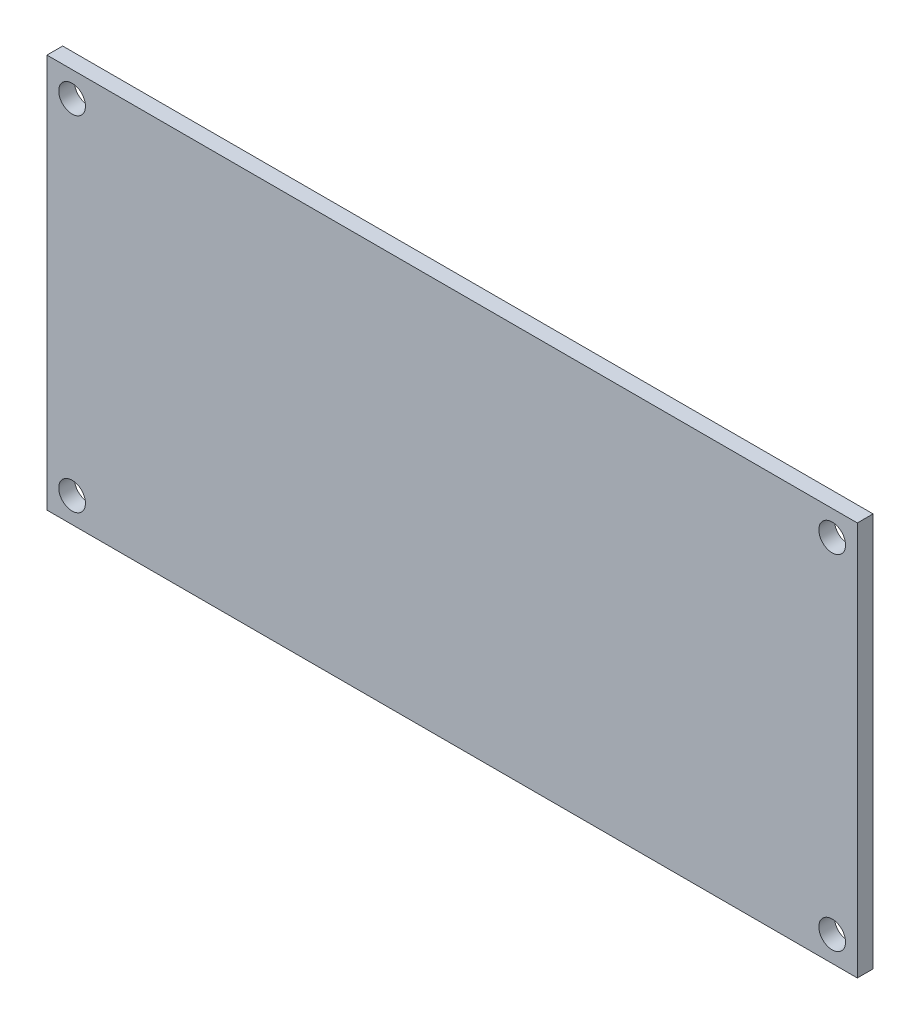
ISO-10303-21;
HEADER;
FILE_DESCRIPTION(('STEP AP214'),'2;1');
FILE_NAME('part.step','',(''),(''),'','','');
FILE_SCHEMA(('AUTOMOTIVE_DESIGN { 1 0 10303 214 1 1 1 1 }'));
ENDSEC;
DATA;
#1=APPLICATION_CONTEXT('core data for automotive mechanical design processes');
#2=APPLICATION_PROTOCOL_DEFINITION('international standard','automotive_design',2000,#1);
#3=PRODUCT_CONTEXT('',#1,'mechanical');
#4=PRODUCT('Part','Part','',(#3));
#5=PRODUCT_RELATED_PRODUCT_CATEGORY('part','',(#4));
#6=PRODUCT_DEFINITION_FORMATION('','',#4);
#7=PRODUCT_DEFINITION_CONTEXT('part definition',#1,'design');
#8=PRODUCT_DEFINITION('design','',#6,#7);
#9=PRODUCT_DEFINITION_SHAPE('','',#8);
#10=(LENGTH_UNIT() NAMED_UNIT(*) SI_UNIT(.MILLI.,.METRE.));
#11=(NAMED_UNIT(*) PLANE_ANGLE_UNIT() SI_UNIT($,.RADIAN.));
#12=(NAMED_UNIT(*) SI_UNIT($,.STERADIAN.) SOLID_ANGLE_UNIT());
#13=UNCERTAINTY_MEASURE_WITH_UNIT(LENGTH_MEASURE(1.E-05),#10,'distance_accuracy_value','');
#14=(GEOMETRIC_REPRESENTATION_CONTEXT(3) GLOBAL_UNCERTAINTY_ASSIGNED_CONTEXT((#13)) GLOBAL_UNIT_ASSIGNED_CONTEXT((#10,
#11,#12)) REPRESENTATION_CONTEXT('',''));
#15=CARTESIAN_POINT('',(0.,0.,0.));
#16=DIRECTION('',(0.,0.,1.));
#17=DIRECTION('',(1.,0.,0.));
#18=AXIS2_PLACEMENT_3D('',#15,#16,#17);
#19=CARTESIAN_POINT('',(3147.17675716415,1169.36369471235,1.5875));
#20=DIRECTION('',(-1.,0.,0.));
#21=DIRECTION('',(0.,0.,1.));
#22=AXIS2_PLACEMENT_3D('',#19,#20,#21);
#23=PLANE('',#22);
#24=DIRECTION('',(0.,1.,0.));
#25=VECTOR('',#24,1.);
#26=CARTESIAN_POINT('',(3147.17675716415,1169.36369471235,0.));
#27=LINE('',#26,#25);
#28=CARTESIAN_POINT('',(3147.17675716415,1129.54769471235,0.));
#29=VERTEX_POINT('',#28);
#30=CARTESIAN_POINT('',(3147.17675716415,1169.36369471235,0.));
#31=VERTEX_POINT('',#30);
#32=EDGE_CURVE('E95',#29,#31,#27,.T.);
#33=ORIENTED_EDGE('',*,*,#32,.T.);
#34=DIRECTION('',(0.,0.,-1.));
#35=VECTOR('',#34,1.);
#36=CARTESIAN_POINT('',(3147.17675716415,1169.36369471235,1.5875));
#37=LINE('',#36,#35);
#38=CARTESIAN_POINT('',(3147.17675716415,1169.36369471235,1.5875));
#39=VERTEX_POINT('',#38);
#40=EDGE_CURVE('E11',#39,#31,#37,.T.);
#41=ORIENTED_EDGE('',*,*,#40,.F.);
#42=DIRECTION('',(0.,1.,0.));
#43=VECTOR('',#42,1.);
#44=CARTESIAN_POINT('',(3147.17675716415,1169.36369471235,1.5875));
#45=LINE('',#44,#43);
#46=CARTESIAN_POINT('',(3147.17675716415,1129.54769471235,1.5875));
#47=VERTEX_POINT('',#46);
#48=EDGE_CURVE('E83',#47,#39,#45,.T.);
#49=ORIENTED_EDGE('',*,*,#48,.F.);
#50=DIRECTION('',(0.,0.,-1.));
#51=VECTOR('',#50,1.);
#52=CARTESIAN_POINT('',(3147.17675716415,1129.54769471235,1.5875));
#53=LINE('',#52,#51);
#54=EDGE_CURVE('E91',#47,#29,#53,.T.);
#55=ORIENTED_EDGE('',*,*,#54,.T.);
#56=EDGE_LOOP('',(#33,#41,#49,#55));
#57=FACE_BOUND('',#56,.T.);
#58=ADVANCED_FACE('F32',(#57),#23,.F.);
#59=CARTESIAN_POINT('',(3065.30075716415,1169.36369471235,1.5875));
#60=DIRECTION('',(0.,-1.,0.));
#61=DIRECTION('',(0.,0.,-1.));
#62=AXIS2_PLACEMENT_3D('',#59,#60,#61);
#63=PLANE('',#62);
#64=DIRECTION('',(-1.,0.,0.));
#65=VECTOR('',#64,1.);
#66=CARTESIAN_POINT('',(3065.30075716415,1169.36369471235,0.));
#67=LINE('',#66,#65);
#68=CARTESIAN_POINT('',(3065.30075716415,1169.36369471235,0.));
#69=VERTEX_POINT('',#68);
#70=EDGE_CURVE('E87',#31,#69,#67,.T.);
#71=ORIENTED_EDGE('',*,*,#70,.T.);
#72=DIRECTION('',(0.,0.,-1.));
#73=VECTOR('',#72,1.);
#74=CARTESIAN_POINT('',(3065.30075716415,1169.36369471235,1.5875));
#75=LINE('',#74,#73);
#76=CARTESIAN_POINT('',(3065.30075716415,1169.36369471235,1.5875));
#77=VERTEX_POINT('',#76);
#78=EDGE_CURVE('E40',#77,#69,#75,.T.);
#79=ORIENTED_EDGE('',*,*,#78,.F.);
#80=DIRECTION('',(-1.,0.,0.));
#81=VECTOR('',#80,1.);
#82=CARTESIAN_POINT('',(3065.30075716415,1169.36369471235,1.5875));
#83=LINE('',#82,#81);
#84=EDGE_CURVE('E78',#39,#77,#83,.T.);
#85=ORIENTED_EDGE('',*,*,#84,.F.);
#86=ORIENTED_EDGE('',*,*,#40,.T.);
#87=EDGE_LOOP('',(#71,#79,#85,#86));
#88=FACE_BOUND('',#87,.T.);
#89=ADVANCED_FACE('F86',(#88),#63,.F.);
#90=CARTESIAN_POINT('',(3065.30075716415,1169.36369471235,1.5875));
#91=DIRECTION('',(1.,0.,0.));
#92=DIRECTION('',(0.,0.,-1.));
#93=AXIS2_PLACEMENT_3D('',#90,#91,#92);
#94=PLANE('',#93);
#95=DIRECTION('',(0.,-1.,0.));
#96=VECTOR('',#95,1.);
#97=CARTESIAN_POINT('',(3065.30075716415,1169.36369471235,0.));
#98=LINE('',#97,#96);
#99=CARTESIAN_POINT('',(3065.30075716415,1129.54769471235,0.));
#100=VERTEX_POINT('',#99);
#101=EDGE_CURVE('E65',#69,#100,#98,.T.);
#102=ORIENTED_EDGE('',*,*,#101,.T.);
#103=DIRECTION('',(0.,0.,-1.));
#104=VECTOR('',#103,1.);
#105=CARTESIAN_POINT('',(3065.30075716415,1129.54769471235,1.5875));
#106=LINE('',#105,#104);
#107=CARTESIAN_POINT('',(3065.30075716415,1129.54769471235,1.5875));
#108=VERTEX_POINT('',#107);
#109=EDGE_CURVE('E88',#108,#100,#106,.T.);
#110=ORIENTED_EDGE('',*,*,#109,.F.);
#111=DIRECTION('',(0.,-1.,0.));
#112=VECTOR('',#111,1.);
#113=CARTESIAN_POINT('',(3065.30075716415,1169.36369471235,1.5875));
#114=LINE('',#113,#112);
#115=EDGE_CURVE('E81',#77,#108,#114,.T.);
#116=ORIENTED_EDGE('',*,*,#115,.F.);
#117=ORIENTED_EDGE('',*,*,#78,.T.);
#118=EDGE_LOOP('',(#102,#110,#116,#117));
#119=FACE_BOUND('',#118,.T.);
#120=ADVANCED_FACE('F89',(#119),#94,.F.);
#121=CARTESIAN_POINT('',(3065.30075716415,1129.54769471235,1.5875));
#122=DIRECTION('',(0.,1.,0.));
#123=DIRECTION('',(0.,0.,1.));
#124=AXIS2_PLACEMENT_3D('',#121,#122,#123);
#125=PLANE('',#124);
#126=DIRECTION('',(1.,0.,0.));
#127=VECTOR('',#126,1.);
#128=CARTESIAN_POINT('',(3065.30075716415,1129.54769471235,0.));
#129=LINE('',#128,#127);
#130=EDGE_CURVE('E71',#100,#29,#129,.T.);
#131=ORIENTED_EDGE('',*,*,#130,.T.);
#132=ORIENTED_EDGE('',*,*,#54,.F.);
#133=DIRECTION('',(1.,0.,0.));
#134=VECTOR('',#133,1.);
#135=CARTESIAN_POINT('',(3065.30075716415,1129.54769471235,1.5875));
#136=LINE('',#135,#134);
#137=EDGE_CURVE('E48',#108,#47,#136,.T.);
#138=ORIENTED_EDGE('',*,*,#137,.F.);
#139=ORIENTED_EDGE('',*,*,#109,.T.);
#140=EDGE_LOOP('',(#131,#132,#138,#139));
#141=FACE_BOUND('',#140,.T.);
#142=ADVANCED_FACE('F103',(#141),#125,.F.);
#143=CARTESIAN_POINT('',(0.,0.,1.5875));
#144=DIRECTION('',(0.,0.,1.));
#145=DIRECTION('',(1.,0.,0.));
#146=AXIS2_PLACEMENT_3D('',#143,#144,#145);
#147=PLANE('',#146);
#148=CARTESIAN_POINT('',(3144.63675716415,1132.08769471235,1.5875));
#149=DIRECTION('',(0.,0.,1.));
#150=DIRECTION('',(1.,0.,0.));
#151=AXIS2_PLACEMENT_3D('',#148,#149,#150);
#152=CIRCLE('',#151,1.34999999999996);
#153=CARTESIAN_POINT('',(3145.98675716415,1132.08769471235,1.5875));
#154=VERTEX_POINT('',#153);
#155=EDGE_CURVE('E129',#154,#154,#152,.T.);
#156=ORIENTED_EDGE('',*,*,#155,.F.);
#157=EDGE_LOOP('',(#156));
#158=FACE_BOUND('',#157,.T.);
#159=CARTESIAN_POINT('',(3067.84075716415,1132.08769471235,1.5875));
#160=DIRECTION('',(0.,0.,1.));
#161=DIRECTION('',(1.,0.,0.));
#162=AXIS2_PLACEMENT_3D('',#159,#160,#161);
#163=CIRCLE('',#162,1.34999999999996);
#164=CARTESIAN_POINT('',(3069.19075716415,1132.08769471235,1.5875));
#165=VERTEX_POINT('',#164);
#166=EDGE_CURVE('E123',#165,#165,#163,.T.);
#167=ORIENTED_EDGE('',*,*,#166,.F.);
#168=EDGE_LOOP('',(#167));
#169=FACE_BOUND('',#168,.T.);
#170=CARTESIAN_POINT('',(3144.63675716415,1166.82369471235,1.5875));
#171=DIRECTION('',(0.,0.,1.));
#172=DIRECTION('',(1.,0.,0.));
#173=AXIS2_PLACEMENT_3D('',#170,#171,#172);
#174=CIRCLE('',#173,1.34999999999996);
#175=CARTESIAN_POINT('',(3145.98675716415,1166.82369471235,1.5875));
#176=VERTEX_POINT('',#175);
#177=EDGE_CURVE('E117',#176,#176,#174,.T.);
#178=ORIENTED_EDGE('',*,*,#177,.F.);
#179=EDGE_LOOP('',(#178));
#180=FACE_BOUND('',#179,.T.);
#181=CARTESIAN_POINT('',(3067.84075716415,1166.82369471235,1.5875));
#182=DIRECTION('',(0.,0.,1.));
#183=DIRECTION('',(1.,0.,0.));
#184=AXIS2_PLACEMENT_3D('',#181,#182,#183);
#185=CIRCLE('',#184,1.34999999999996);
#186=CARTESIAN_POINT('',(3069.19075716415,1166.82369471235,1.5875));
#187=VERTEX_POINT('',#186);
#188=EDGE_CURVE('E111',#187,#187,#185,.T.);
#189=ORIENTED_EDGE('',*,*,#188,.F.);
#190=EDGE_LOOP('',(#189));
#191=FACE_BOUND('',#190,.T.);
#192=ORIENTED_EDGE('',*,*,#48,.T.);
#193=ORIENTED_EDGE('',*,*,#84,.T.);
#194=ORIENTED_EDGE('',*,*,#115,.T.);
#195=ORIENTED_EDGE('',*,*,#137,.T.);
#196=EDGE_LOOP('',(#192,#193,#194,#195));
#197=FACE_BOUND('',#196,.T.);
#198=ADVANCED_FACE('F79',(#158,#169,#180,#191,#197),#147,.T.);
#199=CARTESIAN_POINT('',(0.,0.,0.));
#200=DIRECTION('',(0.,0.,1.));
#201=DIRECTION('',(1.,0.,0.));
#202=AXIS2_PLACEMENT_3D('',#199,#200,#201);
#203=PLANE('',#202);
#204=CARTESIAN_POINT('',(3144.63675716415,1132.08769471235,0.));
#205=DIRECTION('',(0.,0.,1.));
#206=DIRECTION('',(1.,0.,0.));
#207=AXIS2_PLACEMENT_3D('',#204,#205,#206);
#208=CIRCLE('',#207,1.34999999999996);
#209=CARTESIAN_POINT('',(3145.98675716415,1132.08769471235,0.));
#210=VERTEX_POINT('',#209);
#211=EDGE_CURVE('E126',#210,#210,#208,.T.);
#212=ORIENTED_EDGE('',*,*,#211,.T.);
#213=EDGE_LOOP('',(#212));
#214=FACE_BOUND('',#213,.T.);
#215=CARTESIAN_POINT('',(3067.84075716415,1132.08769471235,0.));
#216=DIRECTION('',(0.,0.,1.));
#217=DIRECTION('',(1.,0.,0.));
#218=AXIS2_PLACEMENT_3D('',#215,#216,#217);
#219=CIRCLE('',#218,1.34999999999996);
#220=CARTESIAN_POINT('',(3069.19075716415,1132.08769471235,0.));
#221=VERTEX_POINT('',#220);
#222=EDGE_CURVE('E120',#221,#221,#219,.T.);
#223=ORIENTED_EDGE('',*,*,#222,.T.);
#224=EDGE_LOOP('',(#223));
#225=FACE_BOUND('',#224,.T.);
#226=CARTESIAN_POINT('',(3144.63675716415,1166.82369471235,0.));
#227=DIRECTION('',(0.,0.,1.));
#228=DIRECTION('',(1.,0.,0.));
#229=AXIS2_PLACEMENT_3D('',#226,#227,#228);
#230=CIRCLE('',#229,1.34999999999996);
#231=CARTESIAN_POINT('',(3145.98675716415,1166.82369471235,0.));
#232=VERTEX_POINT('',#231);
#233=EDGE_CURVE('E114',#232,#232,#230,.T.);
#234=ORIENTED_EDGE('',*,*,#233,.T.);
#235=EDGE_LOOP('',(#234));
#236=FACE_BOUND('',#235,.T.);
#237=CARTESIAN_POINT('',(3067.84075716415,1166.82369471235,0.));
#238=DIRECTION('',(0.,0.,1.));
#239=DIRECTION('',(1.,0.,0.));
#240=AXIS2_PLACEMENT_3D('',#237,#238,#239);
#241=CIRCLE('',#240,1.34999999999996);
#242=CARTESIAN_POINT('',(3069.19075716415,1166.82369471235,0.));
#243=VERTEX_POINT('',#242);
#244=EDGE_CURVE('E98',#243,#243,#241,.T.);
#245=ORIENTED_EDGE('',*,*,#244,.T.);
#246=EDGE_LOOP('',(#245));
#247=FACE_BOUND('',#246,.T.);
#248=ORIENTED_EDGE('',*,*,#32,.F.);
#249=ORIENTED_EDGE('',*,*,#130,.F.);
#250=ORIENTED_EDGE('',*,*,#101,.F.);
#251=ORIENTED_EDGE('',*,*,#70,.F.);
#252=EDGE_LOOP('',(#248,#249,#250,#251));
#253=FACE_BOUND('',#252,.T.);
#254=ADVANCED_FACE('F106',(#214,#225,#236,#247,#253),#203,.F.);
#255=CARTESIAN_POINT('',(3067.84075716415,1166.82369471235,1.5875));
#256=DIRECTION('',(0.,0.,1.));
#257=DIRECTION('',(1.,0.,0.));
#258=AXIS2_PLACEMENT_3D('',#255,#256,#257);
#259=CYLINDRICAL_SURFACE('',#258,1.34999999999996);
#260=ORIENTED_EDGE('',*,*,#244,.F.);
#261=EDGE_LOOP('',(#260));
#262=FACE_BOUND('',#261,.T.);
#263=ORIENTED_EDGE('',*,*,#188,.T.);
#264=EDGE_LOOP('',(#263));
#265=FACE_BOUND('',#264,.T.);
#266=ADVANCED_FACE('F144',(#262,#265),#259,.F.);
#267=CARTESIAN_POINT('',(3144.63675716415,1166.82369471235,1.5875));
#268=DIRECTION('',(0.,0.,1.));
#269=DIRECTION('',(1.,0.,0.));
#270=AXIS2_PLACEMENT_3D('',#267,#268,#269);
#271=CYLINDRICAL_SURFACE('',#270,1.34999999999996);
#272=ORIENTED_EDGE('',*,*,#233,.F.);
#273=EDGE_LOOP('',(#272));
#274=FACE_BOUND('',#273,.T.);
#275=ORIENTED_EDGE('',*,*,#177,.T.);
#276=EDGE_LOOP('',(#275));
#277=FACE_BOUND('',#276,.T.);
#278=ADVANCED_FACE('F146',(#274,#277),#271,.F.);
#279=CARTESIAN_POINT('',(3067.84075716415,1132.08769471235,1.5875));
#280=DIRECTION('',(0.,0.,1.));
#281=DIRECTION('',(1.,0.,0.));
#282=AXIS2_PLACEMENT_3D('',#279,#280,#281);
#283=CYLINDRICAL_SURFACE('',#282,1.34999999999996);
#284=ORIENTED_EDGE('',*,*,#222,.F.);
#285=EDGE_LOOP('',(#284));
#286=FACE_BOUND('',#285,.T.);
#287=ORIENTED_EDGE('',*,*,#166,.T.);
#288=EDGE_LOOP('',(#287));
#289=FACE_BOUND('',#288,.T.);
#290=ADVANCED_FACE('F153',(#286,#289),#283,.F.);
#291=CARTESIAN_POINT('',(3144.63675716415,1132.08769471235,1.5875));
#292=DIRECTION('',(0.,0.,1.));
#293=DIRECTION('',(1.,0.,0.));
#294=AXIS2_PLACEMENT_3D('',#291,#292,#293);
#295=CYLINDRICAL_SURFACE('',#294,1.34999999999996);
#296=ORIENTED_EDGE('',*,*,#211,.F.);
#297=EDGE_LOOP('',(#296));
#298=FACE_BOUND('',#297,.T.);
#299=ORIENTED_EDGE('',*,*,#155,.T.);
#300=EDGE_LOOP('',(#299));
#301=FACE_BOUND('',#300,.T.);
#302=ADVANCED_FACE('F133',(#298,#301),#295,.F.);
#303=CLOSED_SHELL('',(#58,#89,#120,#142,#198,#254,#266,#278,#290,#302));
#304=MANIFOLD_SOLID_BREP('B2',#303);
#305=ADVANCED_BREP_SHAPE_REPRESENTATION('',(#18,#304),#14);
#306=SHAPE_DEFINITION_REPRESENTATION(#9,#305);
ENDSEC;
END-ISO-10303-21;
